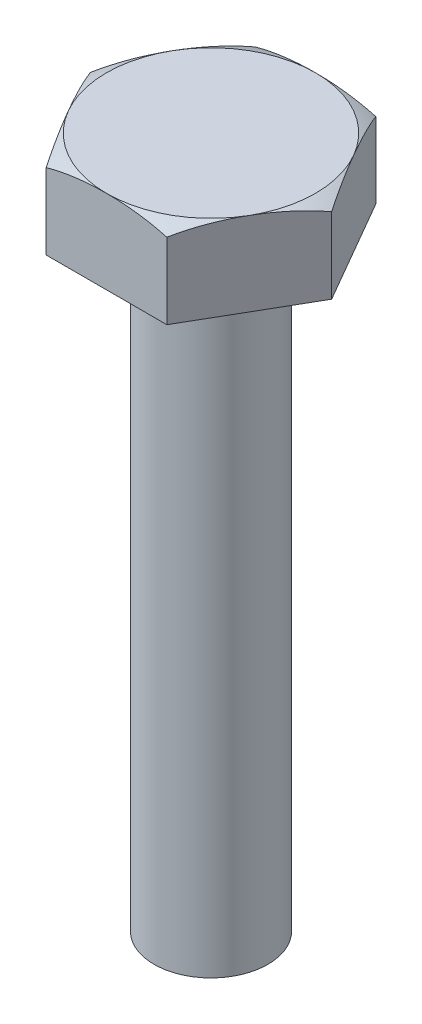
ISO-10303-21;
HEADER;
FILE_DESCRIPTION(('STEP AP214'),'2;1');
FILE_NAME('part.step','',(''),(''),'','','');
FILE_SCHEMA(('AUTOMOTIVE_DESIGN { 1 0 10303 214 1 1 1 1 }'));
ENDSEC;
DATA;
#1=APPLICATION_CONTEXT('core data for automotive mechanical design processes');
#2=APPLICATION_PROTOCOL_DEFINITION('international standard','automotive_design',2000,#1);
#3=PRODUCT_CONTEXT('',#1,'mechanical');
#4=PRODUCT('Part','Part','',(#3));
#5=PRODUCT_RELATED_PRODUCT_CATEGORY('part','',(#4));
#6=PRODUCT_DEFINITION_FORMATION('','',#4);
#7=PRODUCT_DEFINITION_CONTEXT('part definition',#1,'design');
#8=PRODUCT_DEFINITION('design','',#6,#7);
#9=PRODUCT_DEFINITION_SHAPE('','',#8);
#10=(LENGTH_UNIT() NAMED_UNIT(*) SI_UNIT(.MILLI.,.METRE.));
#11=(NAMED_UNIT(*) PLANE_ANGLE_UNIT() SI_UNIT($,.RADIAN.));
#12=(NAMED_UNIT(*) SI_UNIT($,.STERADIAN.) SOLID_ANGLE_UNIT());
#13=UNCERTAINTY_MEASURE_WITH_UNIT(LENGTH_MEASURE(1.E-05),#10,'distance_accuracy_value','');
#14=(GEOMETRIC_REPRESENTATION_CONTEXT(3) GLOBAL_UNCERTAINTY_ASSIGNED_CONTEXT((#13)) GLOBAL_UNIT_ASSIGNED_CONTEXT((#10,
#11,#12)) REPRESENTATION_CONTEXT('',''));
#15=CARTESIAN_POINT('',(0.,0.,0.));
#16=DIRECTION('',(0.,0.,1.));
#17=DIRECTION('',(1.,0.,0.));
#18=AXIS2_PLACEMENT_3D('',#15,#16,#17);
#19=CARTESIAN_POINT('',(1.5877132402715,2.2,2.74999999999998));
#20=DIRECTION('',(-0.866025403784442,0.,-0.499999999999995));
#21=DIRECTION('',(-0.499999999999995,0.,0.866025403784442));
#22=AXIS2_PLACEMENT_3D('',#19,#20,#21);
#23=PLANE('',#22);
#24=CARTESIAN_POINT('',(1.58759777021767,1.99397517685764,2.75019999999998));
#25=CARTESIAN_POINT('',(1.65735474059405,2.03289883855819,2.62937738312601));
#26=CARTESIAN_POINT('',(1.72790703505606,2.06574618628309,2.50717722452725));
#27=CARTESIAN_POINT('',(1.87001686874065,2.12022142000592,2.26103577233036));
#28=CARTESIAN_POINT('',(1.9415732726733,2.14186106954788,2.13709644511209));
#29=CARTESIAN_POINT('',(2.08400235674687,2.17464362019162,1.89040203502117));
#30=CARTESIAN_POINT('',(2.15486520845983,2.18596294060972,1.76766397548509));
#31=CARTESIAN_POINT('',(2.29683467720435,2.19937736424738,1.52176564249602));
#32=CARTESIAN_POINT('',(2.36794137654399,2.2014689650113,1.39860522648124));
#33=CARTESIAN_POINT('',(2.5006646409043,2.19686856462635,1.16872178926279));
#34=CARTESIAN_POINT('',(2.56229152836055,2.19130257207238,1.06198088907623));
#35=CARTESIAN_POINT('',(2.68525591211089,2.17306176488576,0.849000328899248));
#36=CARTESIAN_POINT('',(2.74659353413958,2.16039039550235,0.742760451130094));
#37=CARTESIAN_POINT('',(2.86970549332738,2.12719948420656,0.529524282797477));
#38=CARTESIAN_POINT('',(2.93147207029067,2.10656240051064,0.42254143328744));
#39=CARTESIAN_POINT('',(3.05420872201694,2.05680011487708,0.209955316546661));
#40=CARTESIAN_POINT('',(3.11517787454786,2.02766586102594,0.104353646668687));
#41=CARTESIAN_POINT('',(3.17554195059678,1.99397517685764,-0.000200000000000334));
#42=B_SPLINE_CURVE_WITH_KNOTS('',3,(#24,#25,#26,#27,#28,#29,#30,#31,#32,#33,#34,#35,#36,#37,#38,
#39,#40,#41),.UNSPECIFIED.,.F.,.F.,(4,2,2,2,2,2,2,2,4),(0.,0.434244212082956,0.868031715207851,
1.29425673382773,1.72064351569048,2.0905909374031,2.46035913423433,2.83580614787069,
3.21165458987835),.UNSPECIFIED.);
#43=CARTESIAN_POINT('',(1.58771324025552,1.99403962628832,2.74999999999998));
#44=VERTEX_POINT('',#43);
#45=CARTESIAN_POINT('',(2.3815698604072,2.2,1.37499999999998));
#46=VERTEX_POINT('',#45);
#47=EDGE_CURVE('E213',#44,#46,#42,.T.);
#48=ORIENTED_EDGE('',*,*,#47,.F.);
#49=DIRECTION('',(0.,-1.,0.));
#50=VECTOR('',#49,1.);
#51=CARTESIAN_POINT('',(1.5877132402715,2.2,2.74999999999998));
#52=LINE('',#51,#50);
#53=CARTESIAN_POINT('',(1.5877132402715,0.,2.74999999999998));
#54=VERTEX_POINT('',#53);
#55=EDGE_CURVE('E58',#44,#54,#52,.T.);
#56=ORIENTED_EDGE('',*,*,#55,.T.);
#57=DIRECTION('',(0.499999999999995,0.,-0.866025403784442));
#58=VECTOR('',#57,1.);
#59=CARTESIAN_POINT('',(1.5877132402715,0.,2.74999999999998));
#60=LINE('',#59,#58);
#61=CARTESIAN_POINT('',(3.17542648054294,0.,0.));
#62=VERTEX_POINT('',#61);
#63=EDGE_CURVE('E217',#54,#62,#60,.T.);
#64=ORIENTED_EDGE('',*,*,#63,.T.);
#65=DIRECTION('',(0.,-1.,0.));
#66=VECTOR('',#65,1.);
#67=CARTESIAN_POINT('',(3.17542648054294,2.2,0.));
#68=LINE('',#67,#66);
#69=CARTESIAN_POINT('',(3.17542648052862,1.99403962629186,-2.48178102897653E-11));
#70=VERTEX_POINT('',#69);
#71=EDGE_CURVE('E235',#70,#62,#68,.T.);
#72=ORIENTED_EDGE('',*,*,#71,.F.);
#73=EDGE_CURVE('E215',#46,#70,#42,.T.);
#74=ORIENTED_EDGE('',*,*,#73,.F.);
#75=EDGE_LOOP('',(#48,#56,#64,#72,#74));
#76=FACE_BOUND('',#75,.T.);
#77=ADVANCED_FACE('F34',(#76),#23,.F.);
#78=CARTESIAN_POINT('',(3.17542648054294,2.2,0.));
#79=DIRECTION('',(-0.866025403784438,0.,0.500000000000001));
#80=DIRECTION('',(0.500000000000001,0.,0.866025403784438));
#81=AXIS2_PLACEMENT_3D('',#78,#79,#80);
#82=PLANE('',#81);
#83=CARTESIAN_POINT('',(3.17554195059678,1.99397517685764,0.0002));
#84=CARTESIAN_POINT('',(3.1057849802204,2.03289883855819,-0.120622616873973));
#85=CARTESIAN_POINT('',(3.03523268575839,2.06574618628309,-0.242822775472732));
#86=CARTESIAN_POINT('',(2.89312285207379,2.12022142000592,-0.488964227669619));
#87=CARTESIAN_POINT('',(2.82156644814114,2.14186106954789,-0.61290355488789));
#88=CARTESIAN_POINT('',(2.67913736406757,2.17464362019162,-0.859597964978808));
#89=CARTESIAN_POINT('',(2.60827451235461,2.18596294060973,-0.982336024514884));
#90=CARTESIAN_POINT('',(2.46630504361009,2.19937736424738,-1.22823435750395));
#91=CARTESIAN_POINT('',(2.39519834427045,2.20146896501131,-1.35139477351874));
#92=CARTESIAN_POINT('',(2.26247507991014,2.19686856462636,-1.58127821073719));
#93=CARTESIAN_POINT('',(2.20084819245388,2.19130257207239,-1.68801911092376));
#94=CARTESIAN_POINT('',(2.07788380870354,2.17306176488576,-1.90099967110074));
#95=CARTESIAN_POINT('',(2.01654618667484,2.16039039550235,-2.00723954886989));
#96=CARTESIAN_POINT('',(1.89343422748704,2.12719948420656,-2.22047571720252));
#97=CARTESIAN_POINT('',(1.83166765052375,2.10656240051065,-2.32745856671256));
#98=CARTESIAN_POINT('',(1.70893099879748,2.05680011487708,-2.54004468345334));
#99=CARTESIAN_POINT('',(1.64796184626655,2.02766586102594,-2.64564635333132));
#100=CARTESIAN_POINT('',(1.58759777021763,1.99397517685764,-2.75020000000001));
#101=B_SPLINE_CURVE_WITH_KNOTS('',3,(#83,#84,#85,#86,#87,#88,#89,#90,#91,#92,#93,#94,#95,#96,
#97,#98,#99,#100),.UNSPECIFIED.,.F.,.F.,(4,2,2,2,2,2,2,2,4),(0.,0.434244212082956,
0.868031715207852,1.29425673382773,1.72064351569048,2.09059093740311,2.46035913423435,
2.83580614787072,3.21165458987839),.UNSPECIFIED.);
#102=CARTESIAN_POINT('',(2.38156986040719,2.2,-1.37499999999999));
#103=VERTEX_POINT('',#102);
#104=EDGE_CURVE('E262',#70,#103,#101,.T.);
#105=ORIENTED_EDGE('',*,*,#104,.F.);
#106=ORIENTED_EDGE('',*,*,#71,.T.);
#107=DIRECTION('',(-0.500000000000001,0.,-0.866025403784438));
#108=VECTOR('',#107,1.);
#109=CARTESIAN_POINT('',(3.17542648054294,0.,0.));
#110=LINE('',#109,#108);
#111=CARTESIAN_POINT('',(1.58771324027147,0.,-2.75000000000001));
#112=VERTEX_POINT('',#111);
#113=EDGE_CURVE('E252',#62,#112,#110,.T.);
#114=ORIENTED_EDGE('',*,*,#113,.T.);
#115=DIRECTION('',(0.,-1.,0.));
#116=VECTOR('',#115,1.);
#117=CARTESIAN_POINT('',(1.58771324027147,2.2,-2.75000000000001));
#118=LINE('',#117,#116);
#119=CARTESIAN_POINT('',(1.58771324027147,1.99403962628386,-2.75000000000001));
#120=VERTEX_POINT('',#119);
#121=EDGE_CURVE('E234',#120,#112,#118,.T.);
#122=ORIENTED_EDGE('',*,*,#121,.F.);
#123=EDGE_CURVE('E117',#103,#120,#101,.T.);
#124=ORIENTED_EDGE('',*,*,#123,.F.);
#125=EDGE_LOOP('',(#105,#106,#114,#122,#124));
#126=FACE_BOUND('',#125,.T.);
#127=ADVANCED_FACE('F206',(#126),#82,.F.);
#128=CARTESIAN_POINT('',(1.58771324027147,2.2,-2.75000000000001));
#129=DIRECTION('',(0.,0.,1.));
#130=DIRECTION('',(1.,0.,0.));
#131=AXIS2_PLACEMENT_3D('',#128,#129,#130);
#132=PLANE('',#131);
#133=CARTESIAN_POINT('',(3.61354192767303,-3.86327304271267,-2.75000000000001));
#134=CARTESIAN_POINT('',(3.67920515375837,-3.78751554514719,-2.75000000000001));
#135=CARTESIAN_POINT('',(3.74175196263034,-3.70905040836444,-2.75000000000001));
#136=CARTESIAN_POINT('',(3.86013726797628,-3.54719612775103,-2.75000000000001));
#137=CARTESIAN_POINT('',(3.91597474041051,-3.46380623514914,-2.75000000000001));
#138=CARTESIAN_POINT('',(4.02045498068704,-3.29260171406876,-2.75000000000001));
#139=CARTESIAN_POINT('',(4.0690964519699,-3.20478629202026,-2.75000000000001));
#140=CARTESIAN_POINT('',(4.15874530035373,-3.02537891666946,-2.75000000000001));
#141=CARTESIAN_POINT('',(4.1997532320115,-2.93378723829332,-2.75000000000001));
#142=CARTESIAN_POINT('',(4.31087034072191,-2.65398096801806,-2.75000000000002));
#143=CARTESIAN_POINT('',(4.36901199697039,-2.46083468956861,-2.75000000000002));
#144=CARTESIAN_POINT('',(4.45105454078483,-2.06761817700911,-2.75000000000002));
#145=CARTESIAN_POINT('',(4.47497671196494,-1.86755232607549,-2.75000000000002));
#146=CARTESIAN_POINT('',(4.4877078635264,-1.47118109425215,-2.75000000000002));
#147=CARTESIAN_POINT('',(4.47735876220512,-1.27490296284074,-2.75000000000002));
#148=CARTESIAN_POINT('',(4.42372525955767,-0.886873107250622,-2.75000000000002));
#149=CARTESIAN_POINT('',(4.38043502592531,-0.695122190825371,-2.75000000000002));
#150=CARTESIAN_POINT('',(4.26257552836183,-0.322195475768846,-2.75000000000002));
#151=CARTESIAN_POINT('',(4.18810848027408,-0.140987303302729,-2.75000000000001));
#152=CARTESIAN_POINT('',(4.01039043070335,0.206669546491524,-2.75000000000001));
#153=CARTESIAN_POINT('',(3.90714033102935,0.373118686023284,-2.75000000000001));
#154=CARTESIAN_POINT('',(3.67282493790998,0.690402005944507,-2.75000000000001));
#155=CARTESIAN_POINT('',(3.5412338551679,0.84084711026739,-2.75000000000001));
#156=CARTESIAN_POINT('',(3.25586014655884,1.11886355352082,-2.75000000000001));
#157=CARTESIAN_POINT('',(3.10207604013043,1.24643336509943,-2.75000000000001));
#158=CARTESIAN_POINT('',(2.76792719650014,1.48323037087921,-2.75000000000001));
#159=CARTESIAN_POINT('',(2.58655655833858,1.59103153018854,-2.75000000000001));
#160=CARTESIAN_POINT('',(2.209918429767,1.77854424736317,-2.75000000000001));
#161=CARTESIAN_POINT('',(2.01464766704068,1.8582491644533,-2.75000000000001));
#162=CARTESIAN_POINT('',(1.66765333448022,1.97363974954955,-2.75000000000001));
#163=CARTESIAN_POINT('',(1.51788141349224,2.01538549444225,-2.75));
#164=CARTESIAN_POINT('',(1.21517702161041,2.0854819305404,-2.75));
#165=CARTESIAN_POINT('',(1.06224302405238,2.11382598591734,-2.75));
#166=CARTESIAN_POINT('',(0.7540445142738,2.1583971088112,-2.75));
#167=CARTESIAN_POINT('',(0.598773186301566,2.17457591186841,-2.75));
#168=CARTESIAN_POINT('',(0.287492227271082,2.19564217048328,-2.75));
#169=CARTESIAN_POINT('',(0.131482629330214,2.20053012780464,-2.75));
#170=CARTESIAN_POINT('',(-0.186094354239489,2.1993587601162,-2.75));
#171=CARTESIAN_POINT('',(-0.347660472196816,2.19290067823936,-2.75));
#172=CARTESIAN_POINT('',(-0.669873998715494,2.16775653759,-2.75));
#173=CARTESIAN_POINT('',(-0.830521328236719,2.1490694422967,-2.75));
#174=CARTESIAN_POINT('',(-1.14910155604353,2.09836217677706,-2.75));
#175=CARTESIAN_POINT('',(-1.30704266260817,2.06639489641723,-2.75));
#176=CARTESIAN_POINT('',(-1.61916567569023,1.98780432663456,-2.74999999999999));
#177=CARTESIAN_POINT('',(-1.77334951558514,1.94118875404098,-2.74999999999999));
#178=CARTESIAN_POINT('',(-2.13874739372891,1.80954499714141,-2.74999999999999));
#179=CARTESIAN_POINT('',(-2.3472111137507,1.71660358229473,-2.74999999999999));
#180=CARTESIAN_POINT('',(-2.74618767044452,1.49772007480806,-2.74999999999999));
#181=CARTESIAN_POINT('',(-2.93670142577896,1.3717796722741,-2.74999999999999));
#182=CARTESIAN_POINT('',(-3.29363002803232,1.08740389153575,-2.74999999999999));
#183=CARTESIAN_POINT('',(-3.45990682757709,0.928793909082675,-2.74999999999999));
#184=CARTESIAN_POINT('',(-3.76011448643433,0.58335089151248,-2.74999999999999));
#185=CARTESIAN_POINT('',(-3.89405150469049,0.396523241338111,-2.74999999999999));
#186=CARTESIAN_POINT('',(-4.11316765720423,0.0188453762913879,-2.74999999999999));
#187=CARTESIAN_POINT('',(-4.20168697643794,-0.170072302267666,-2.74999999999999));
#188=CARTESIAN_POINT('',(-4.34388706228101,-0.560578145800984,-2.74999999999999));
#189=CARTESIAN_POINT('',(-4.39758072064666,-0.762161591818494,-2.74999999999998));
#190=CARTESIAN_POINT('',(-4.46639330879461,-1.16160452086589,-2.74999999999998));
#191=CARTESIAN_POINT('',(-4.48327299376118,-1.35916271104197,-2.74999999999998));
#192=CARTESIAN_POINT('',(-4.48314329927845,-1.75425671067879,-2.74999999999998));
#193=CARTESIAN_POINT('',(-4.46613904975492,-1.9517925190001,-2.74999999999998));
#194=CARTESIAN_POINT('',(-4.39928607970651,-2.3385592621985,-2.74999999999998));
#195=CARTESIAN_POINT('',(-4.34986389612912,-2.52786445931962,-2.74999999999998));
#196=CARTESIAN_POINT('',(-4.22022237715089,-2.89561653417511,-2.74999999999999));
#197=CARTESIAN_POINT('',(-4.14001083250568,-3.07406614551987,-2.74999999999999));
#198=CARTESIAN_POINT('',(-3.9848152568671,-3.35508310728068,-2.74999999999999));
#199=CARTESIAN_POINT('',(-3.91795136207254,-3.46222931800156,-2.74999999999999));
#200=CARTESIAN_POINT('',(-3.77353961774678,-3.66874577687791,-2.74999999999999));
#201=CARTESIAN_POINT('',(-3.69601347353394,-3.76813119529961,-2.74999999999999));
#202=CARTESIAN_POINT('',(-3.61354192767304,-3.86327304271268,-2.74999999999999));
#203=B_SPLINE_CURVE_WITH_KNOTS('',3,(#133,#134,#135,#136,#137,#138,#139,#140,#141,#142,#143,
#144,#145,#146,#147,#148,#149,#150,#151,#152,#153,#154,#155,#156,#157,#158,#159,#160,#161,#162,
#163,#164,#165,#166,#167,#168,#169,#170,#171,#172,#173,#174,#175,#176,#177,#178,#179,#180,#181,
#182,#183,#184,#185,#186,#187,#188,#189,#190,#191,#192,#193,#194,#195,#196,#197,#198,#199,#200,
#201,#202),.UNSPECIFIED.,.F.,.F.,(4,2,2,2,2,2,2,2,2,2,2,2,2,2,2,2,2,2,2,2,2,2,2,2,2,2,2,2,2,2,2,
2,2,2,4),(0.,0.300683542050386,0.601412919009879,0.902196414897401,1.2029580511107,
1.80482679372907,2.40632102690421,2.99314945443728,3.58008180552783,4.16510473438295,
4.75010933579825,5.3470809521294,5.94409241260724,6.57451436214468,7.20508521728016,
7.67091061348533,8.13696642158713,8.60486164402899,9.07273607286824,9.55738440803847,
10.0420738269113,10.5248511439352,11.0073745554564,11.6892131114826,12.3710167526718,
13.0565635547703,13.7419796948752,14.364674808172,14.9871392805552,15.5791121128826,
16.1709953291129,16.7552430101009,17.3393429539009,17.7175926397199,18.0950834101514),.UNSPECIFIED.);
#204=CARTESIAN_POINT('',(0.,2.2,-2.74999999999998));
#205=VERTEX_POINT('',#204);
#206=EDGE_CURVE('E110',#120,#205,#203,.T.);
#207=ORIENTED_EDGE('',*,*,#206,.F.);
#208=ORIENTED_EDGE('',*,*,#121,.T.);
#209=DIRECTION('',(-1.,0.,0.));
#210=VECTOR('',#209,1.);
#211=CARTESIAN_POINT('',(1.58771324027147,0.,-2.75000000000001));
#212=LINE('',#211,#210);
#213=CARTESIAN_POINT('',(-1.58771324027148,0.,-2.74999999999999));
#214=VERTEX_POINT('',#213);
#215=EDGE_CURVE('E254',#112,#214,#212,.T.);
#216=ORIENTED_EDGE('',*,*,#215,.T.);
#217=DIRECTION('',(0.,-1.,0.));
#218=VECTOR('',#217,1.);
#219=CARTESIAN_POINT('',(-1.58771324027148,2.2,-2.74999999999999));
#220=LINE('',#219,#218);
#221=CARTESIAN_POINT('',(-1.58771324028584,1.99403962629187,-2.74999999997514));
#222=VERTEX_POINT('',#221);
#223=EDGE_CURVE('E141',#222,#214,#220,.T.);
#224=ORIENTED_EDGE('',*,*,#223,.F.);
#225=EDGE_CURVE('E121',#205,#222,#203,.T.);
#226=ORIENTED_EDGE('',*,*,#225,.F.);
#227=EDGE_LOOP('',(#207,#208,#216,#224,#226));
#228=FACE_BOUND('',#227,.T.);
#229=ADVANCED_FACE('F139',(#228),#132,.F.);
#230=CARTESIAN_POINT('',(-1.58771324027148,2.2,-2.74999999999999));
#231=DIRECTION('',(0.866025403784442,0.,0.499999999999995));
#232=DIRECTION('',(0.499999999999995,0.,-0.866025403784442));
#233=AXIS2_PLACEMENT_3D('',#230,#231,#232);
#234=PLANE('',#233);
#235=CARTESIAN_POINT('',(-1.58759777021765,1.99397517685764,-2.75019999999999));
#236=CARTESIAN_POINT('',(-1.65735474059403,2.03289883855819,-2.62937738312602));
#237=CARTESIAN_POINT('',(-1.72790703505604,2.06574618628309,-2.50717722452726));
#238=CARTESIAN_POINT('',(-1.87001686874063,2.12022142000592,-2.26103577233037));
#239=CARTESIAN_POINT('',(-1.94157327267328,2.14186106954789,-2.1370964451121));
#240=CARTESIAN_POINT('',(-2.08400235674685,2.17464362019162,-1.89040203502118));
#241=CARTESIAN_POINT('',(-2.15486520845981,2.18596294060973,-1.76766397548511));
#242=CARTESIAN_POINT('',(-2.29683467720433,2.19937736424738,-1.52176564249604));
#243=CARTESIAN_POINT('',(-2.36794137654397,2.20146896501131,-1.39860522648125));
#244=CARTESIAN_POINT('',(-2.50066464090428,2.19686856462636,-1.1687217892628));
#245=CARTESIAN_POINT('',(-2.56229152836054,2.19130257207239,-1.06198088907623));
#246=CARTESIAN_POINT('',(-2.68525591211087,2.17306176488576,-0.849000328899249));
#247=CARTESIAN_POINT('',(-2.74659353413957,2.16039039550236,-0.742760451130092));
#248=CARTESIAN_POINT('',(-2.86970549332737,2.12719948420656,-0.529524282797469));
#249=CARTESIAN_POINT('',(-2.93147207029067,2.10656240051065,-0.422541433287429));
#250=CARTESIAN_POINT('',(-3.05420872201693,2.05680011487708,-0.209955316546644));
#251=CARTESIAN_POINT('',(-3.11517787454786,2.02766586102594,-0.104353646668667));
#252=CARTESIAN_POINT('',(-3.17554195059678,1.99397517685764,0.000200000000021938));
#253=B_SPLINE_CURVE_WITH_KNOTS('',3,(#235,#236,#237,#238,#239,#240,#241,#242,#243,#244,#245,
#246,#247,#248,#249,#250,#251,#252),.UNSPECIFIED.,.F.,.F.,(4,2,2,2,2,2,2,2,4),(0.,
0.434244212082957,0.868031715207852,1.29425673382773,1.72064351569048,2.09059093740311,
2.46035913423435,2.83580614787072,3.21165458987839),.UNSPECIFIED.);
#254=CARTESIAN_POINT('',(-2.3815698604072,2.2,-1.37499999999998));
#255=VERTEX_POINT('',#254);
#256=EDGE_CURVE('E128',#222,#255,#253,.T.);
#257=ORIENTED_EDGE('',*,*,#256,.F.);
#258=ORIENTED_EDGE('',*,*,#223,.T.);
#259=DIRECTION('',(-0.499999999999995,0.,0.866025403784442));
#260=VECTOR('',#259,1.);
#261=CARTESIAN_POINT('',(-1.58771324027148,0.,-2.74999999999999));
#262=LINE('',#261,#260);
#263=CARTESIAN_POINT('',(-3.17542648054294,0.,0.));
#264=VERTEX_POINT('',#263);
#265=EDGE_CURVE('E249',#214,#264,#262,.T.);
#266=ORIENTED_EDGE('',*,*,#265,.T.);
#267=DIRECTION('',(0.,-1.,0.));
#268=VECTOR('',#267,1.);
#269=CARTESIAN_POINT('',(-3.17542648054294,2.2,0.));
#270=LINE('',#269,#268);
#271=CARTESIAN_POINT('',(-3.17542648052861,1.99403962629186,2.48496030176258E-11));
#272=VERTEX_POINT('',#271);
#273=EDGE_CURVE('E226',#272,#264,#270,.T.);
#274=ORIENTED_EDGE('',*,*,#273,.F.);
#275=EDGE_CURVE('E142',#255,#272,#253,.T.);
#276=ORIENTED_EDGE('',*,*,#275,.F.);
#277=EDGE_LOOP('',(#257,#258,#266,#274,#276));
#278=FACE_BOUND('',#277,.T.);
#279=ADVANCED_FACE('F197',(#278),#234,.F.);
#280=CARTESIAN_POINT('',(-3.17542648054294,2.2,0.));
#281=DIRECTION('',(0.866025403784435,0.,-0.500000000000007));
#282=DIRECTION('',(-0.500000000000007,0.,-0.866025403784435));
#283=AXIS2_PLACEMENT_3D('',#280,#281,#282);
#284=PLANE('',#283);
#285=CARTESIAN_POINT('',(-3.17554195059678,1.99397517685764,-0.000199999999977892));
#286=CARTESIAN_POINT('',(-3.1057849802204,2.03289883855819,0.120622616873995));
#287=CARTESIAN_POINT('',(-3.03523268575839,2.06574618628309,0.242822775472754));
#288=CARTESIAN_POINT('',(-2.89312285207379,2.12022142000592,0.488964227669639));
#289=CARTESIAN_POINT('',(-2.82156644814114,2.14186106954789,0.612903554887909));
#290=CARTESIAN_POINT('',(-2.67913736406757,2.17464362019162,0.859597964978826));
#291=CARTESIAN_POINT('',(-2.6082745123546,2.18596294060973,0.982336024514902));
#292=CARTESIAN_POINT('',(-2.46630504361008,2.19937736424738,1.22823435750397));
#293=CARTESIAN_POINT('',(-2.39519834427044,2.20146896501131,1.35139477351875));
#294=CARTESIAN_POINT('',(-2.26247507991013,2.19686856462636,1.5812782107372));
#295=CARTESIAN_POINT('',(-2.20084819245387,2.19130257207239,1.68801911092377));
#296=CARTESIAN_POINT('',(-2.07788380870353,2.17306176488576,1.90099967110075));
#297=CARTESIAN_POINT('',(-2.01654618667483,2.16039039550236,2.00723954886991));
#298=CARTESIAN_POINT('',(-1.89343422748703,2.12719948420656,2.22047571720253));
#299=CARTESIAN_POINT('',(-1.83166765052373,2.10656240051065,2.32745856671257));
#300=CARTESIAN_POINT('',(-1.70893099879746,2.05680011487708,2.54004468345335));
#301=CARTESIAN_POINT('',(-1.64796184626654,2.02766586102594,2.64564635333133));
#302=CARTESIAN_POINT('',(-1.58759777021761,1.99397517685764,2.75020000000002));
#303=B_SPLINE_CURVE_WITH_KNOTS('',3,(#285,#286,#287,#288,#289,#290,#291,#292,#293,#294,#295,
#296,#297,#298,#299,#300,#301,#302),.UNSPECIFIED.,.F.,.F.,(4,2,2,2,2,2,2,2,4),(0.,
0.434244212082956,0.868031715207851,1.29425673382773,1.72064351569048,2.09059093740311,
2.46035913423435,2.83580614787072,3.21165458987839),.UNSPECIFIED.);
#304=CARTESIAN_POINT('',(-2.38156986040718,2.2,1.37500000000001));
#305=VERTEX_POINT('',#304);
#306=EDGE_CURVE('E191',#272,#305,#303,.T.);
#307=ORIENTED_EDGE('',*,*,#306,.F.);
#308=ORIENTED_EDGE('',*,*,#273,.T.);
#309=DIRECTION('',(0.500000000000007,0.,0.866025403784435));
#310=VECTOR('',#309,1.);
#311=CARTESIAN_POINT('',(-3.17542648054294,0.,0.));
#312=LINE('',#311,#310);
#313=CARTESIAN_POINT('',(-1.58771324027145,0.,2.75000000000002));
#314=VERTEX_POINT('',#313);
#315=EDGE_CURVE('E228',#264,#314,#312,.T.);
#316=ORIENTED_EDGE('',*,*,#315,.T.);
#317=DIRECTION('',(0.,-1.,0.));
#318=VECTOR('',#317,1.);
#319=CARTESIAN_POINT('',(-1.58771324027145,2.2,2.75000000000002));
#320=LINE('',#319,#318);
#321=CARTESIAN_POINT('',(-1.58771324027145,1.99403962628386,2.75000000000002));
#322=VERTEX_POINT('',#321);
#323=EDGE_CURVE('E224',#322,#314,#320,.T.);
#324=ORIENTED_EDGE('',*,*,#323,.F.);
#325=EDGE_CURVE('E184',#305,#322,#303,.T.);
#326=ORIENTED_EDGE('',*,*,#325,.F.);
#327=EDGE_LOOP('',(#307,#308,#316,#324,#326));
#328=FACE_BOUND('',#327,.T.);
#329=ADVANCED_FACE('F193',(#328),#284,.F.);
#330=CARTESIAN_POINT('',(-1.58771324027145,2.2,2.75000000000002));
#331=DIRECTION('',(0.,0.,-1.));
#332=DIRECTION('',(-1.,0.,0.));
#333=AXIS2_PLACEMENT_3D('',#330,#331,#332);
#334=PLANE('',#333);
#335=CARTESIAN_POINT('',(-3.61354192767303,-3.86327304271264,2.75000000000004));
#336=CARTESIAN_POINT('',(-3.67920515375837,-3.78751554514717,2.75000000000004));
#337=CARTESIAN_POINT('',(-3.74175196263034,-3.70905040836441,2.75000000000004));
#338=CARTESIAN_POINT('',(-3.86013726797628,-3.547196127751,2.75000000000004));
#339=CARTESIAN_POINT('',(-3.91597474041051,-3.46380623514911,2.75000000000004));
#340=CARTESIAN_POINT('',(-4.02045498068704,-3.29260171406873,2.75000000000004));
#341=CARTESIAN_POINT('',(-4.0690964519699,-3.20478629202023,2.75000000000004));
#342=CARTESIAN_POINT('',(-4.15874530035372,-3.02537891666943,2.75000000000004));
#343=CARTESIAN_POINT('',(-4.1997532320115,-2.93378723829329,2.75000000000004));
#344=CARTESIAN_POINT('',(-4.3108703407219,-2.65398096801803,2.75000000000004));
#345=CARTESIAN_POINT('',(-4.36901199697039,-2.46083468956858,2.75000000000005));
#346=CARTESIAN_POINT('',(-4.45105454078482,-2.06761817700907,2.75000000000005));
#347=CARTESIAN_POINT('',(-4.47497671196493,-1.86755232607545,2.75000000000005));
#348=CARTESIAN_POINT('',(-4.48770786352638,-1.47118109425212,2.75000000000005));
#349=CARTESIAN_POINT('',(-4.4773587622051,-1.2749029628407,2.75000000000005));
#350=CARTESIAN_POINT('',(-4.42372525955765,-0.886873107250589,2.75000000000005));
#351=CARTESIAN_POINT('',(-4.38043502592528,-0.695122190825339,2.75000000000005));
#352=CARTESIAN_POINT('',(-4.2625755283618,-0.322195475768814,2.75000000000004));
#353=CARTESIAN_POINT('',(-4.18810848027405,-0.140987303302698,2.75000000000004));
#354=CARTESIAN_POINT('',(-4.01039043070331,0.206669546491554,2.75000000000004));
#355=CARTESIAN_POINT('',(-3.90714033102931,0.373118686023312,2.75000000000004));
#356=CARTESIAN_POINT('',(-3.67282493790993,0.690402005944532,2.75000000000004));
#357=CARTESIAN_POINT('',(-3.54123385516786,0.840847110267416,2.75000000000004));
#358=CARTESIAN_POINT('',(-3.2558601465588,1.11886355352084,2.75000000000003));
#359=CARTESIAN_POINT('',(-3.10207604013039,1.24643336509946,2.75000000000003));
#360=CARTESIAN_POINT('',(-2.76792719650009,1.48323037087923,2.75000000000003));
#361=CARTESIAN_POINT('',(-2.58655655833853,1.59103153018855,2.75000000000003));
#362=CARTESIAN_POINT('',(-2.20991842976695,1.77854424736318,2.75000000000002));
#363=CARTESIAN_POINT('',(-2.01464766704063,1.85824916445332,2.75000000000002));
#364=CARTESIAN_POINT('',(-1.66765333448017,1.97363974954956,2.75000000000002));
#365=CARTESIAN_POINT('',(-1.51788141349218,2.01538549444226,2.75000000000002));
#366=CARTESIAN_POINT('',(-1.21517702161035,2.08548193054041,2.75000000000001));
#367=CARTESIAN_POINT('',(-1.06224302405231,2.11382598591735,2.75000000000001));
#368=CARTESIAN_POINT('',(-0.754044514273732,2.1583971088112,2.75000000000001));
#369=CARTESIAN_POINT('',(-0.598773186301496,2.17457591186842,2.75000000000001));
#370=CARTESIAN_POINT('',(-0.28749222727101,2.19564217048328,2.75));
#371=CARTESIAN_POINT('',(-0.131482629330141,2.20053012780464,2.75));
#372=CARTESIAN_POINT('',(0.186094354239566,2.1993587601162,2.75));
#373=CARTESIAN_POINT('',(0.347660472196895,2.19290067823936,2.75));
#374=CARTESIAN_POINT('',(0.669873998715575,2.16775653759,2.74999999999999));
#375=CARTESIAN_POINT('',(0.8305213282368,2.14906944229669,2.74999999999999));
#376=CARTESIAN_POINT('',(1.14910155604361,2.09836217677705,2.74999999999999));
#377=CARTESIAN_POINT('',(1.30704266260826,2.06639489641722,2.74999999999999));
#378=CARTESIAN_POINT('',(1.61916567569032,1.98780432663454,2.74999999999998));
#379=CARTESIAN_POINT('',(1.77334951558523,1.94118875404096,2.74999999999998));
#380=CARTESIAN_POINT('',(2.13874739372899,1.80954499714139,2.74999999999998));
#381=CARTESIAN_POINT('',(2.34721111375078,1.7166035822947,2.74999999999998));
#382=CARTESIAN_POINT('',(2.74618767044459,1.49772007480803,2.74999999999997));
#383=CARTESIAN_POINT('',(2.93670142577903,1.37177967227406,2.74999999999997));
#384=CARTESIAN_POINT('',(3.29363002803238,1.08740389153571,2.74999999999997));
#385=CARTESIAN_POINT('',(3.45990682757715,0.928793909082632,2.74999999999996));
#386=CARTESIAN_POINT('',(3.76011448643438,0.583350891512435,2.74999999999996));
#387=CARTESIAN_POINT('',(3.89405150469054,0.396523241338066,2.74999999999996));
#388=CARTESIAN_POINT('',(4.11316765720428,0.0188453762913422,2.74999999999996));
#389=CARTESIAN_POINT('',(4.20168697643797,-0.170072302267712,2.74999999999996));
#390=CARTESIAN_POINT('',(4.34388706228104,-0.560578145801032,2.74999999999996));
#391=CARTESIAN_POINT('',(4.39758072064669,-0.762161591818542,2.74999999999995));
#392=CARTESIAN_POINT('',(4.46639330879464,-1.16160452086594,2.74999999999995));
#393=CARTESIAN_POINT('',(4.4832729937612,-1.35916271104202,2.74999999999995));
#394=CARTESIAN_POINT('',(4.48314329927846,-1.75425671067884,2.74999999999995));
#395=CARTESIAN_POINT('',(4.46613904975494,-1.95179251900015,2.74999999999995));
#396=CARTESIAN_POINT('',(4.39928607970652,-2.33855926219855,2.74999999999995));
#397=CARTESIAN_POINT('',(4.34986389612912,-2.52786445931966,2.74999999999995));
#398=CARTESIAN_POINT('',(4.22022237715089,-2.89561653417516,2.74999999999996));
#399=CARTESIAN_POINT('',(4.14001083250568,-3.07406614551992,2.74999999999996));
#400=CARTESIAN_POINT('',(3.98481525686711,-3.35508310728069,2.74999999999996));
#401=CARTESIAN_POINT('',(3.91795136207256,-3.46222931800155,2.74999999999996));
#402=CARTESIAN_POINT('',(3.77353961774685,-3.66874577687784,2.74999999999996));
#403=CARTESIAN_POINT('',(3.69601347353403,-3.76813119529952,2.74999999999996));
#404=CARTESIAN_POINT('',(3.61354192767316,-3.86327304271257,2.74999999999996));
#405=B_SPLINE_CURVE_WITH_KNOTS('',3,(#335,#336,#337,#338,#339,#340,#341,#342,#343,#344,#345,
#346,#347,#348,#349,#350,#351,#352,#353,#354,#355,#356,#357,#358,#359,#360,#361,#362,#363,#364,
#365,#366,#367,#368,#369,#370,#371,#372,#373,#374,#375,#376,#377,#378,#379,#380,#381,#382,#383,
#384,#385,#386,#387,#388,#389,#390,#391,#392,#393,#394,#395,#396,#397,#398,#399,#400,#401,#402,
#403,#404),.UNSPECIFIED.,.F.,.F.,(4,2,2,2,2,2,2,2,2,2,2,2,2,2,2,2,2,2,2,2,2,2,2,2,2,2,2,2,2,2,2,
2,2,2,4),(0.,0.300683542050386,0.60141291900988,0.902196414897401,1.2029580511107,
1.80482679372907,2.40632102690421,2.99314945443728,3.58008180552783,4.16510473438295,
4.75010933579825,5.3470809521294,5.94409241260725,6.57451436214468,7.20508521728016,
7.67091061348534,8.13696642158714,8.60486164402901,9.07273607286826,9.55738440803849,
10.0420738269113,10.5248511439352,11.0073745554564,11.6892131114826,12.3710167526719,
13.0565635547703,13.7419796948752,14.364674808172,14.9871392805552,15.5791121128826,
16.1709953291129,16.7552430101009,17.339342953901,17.7175926397198,18.0950834101513),.UNSPECIFIED.);
#406=CARTESIAN_POINT('',(0.,2.2,2.75));
#407=VERTEX_POINT('',#406);
#408=EDGE_CURVE('E192',#322,#407,#405,.T.);
#409=ORIENTED_EDGE('',*,*,#408,.F.);
#410=ORIENTED_EDGE('',*,*,#323,.T.);
#411=DIRECTION('',(1.,0.,0.));
#412=VECTOR('',#411,1.);
#413=CARTESIAN_POINT('',(-1.58771324027145,0.,2.75000000000002));
#414=LINE('',#413,#412);
#415=EDGE_CURVE('E222',#314,#54,#414,.T.);
#416=ORIENTED_EDGE('',*,*,#415,.T.);
#417=ORIENTED_EDGE('',*,*,#55,.F.);
#418=EDGE_CURVE('E135',#407,#44,#405,.T.);
#419=ORIENTED_EDGE('',*,*,#418,.F.);
#420=EDGE_LOOP('',(#409,#410,#416,#417,#419));
#421=FACE_BOUND('',#420,.T.);
#422=ADVANCED_FACE('F196',(#421),#334,.F.);
#423=CARTESIAN_POINT('',(0.,0.,0.));
#424=DIRECTION('',(0.,1.,0.));
#425=DIRECTION('',(0.,0.,1.));
#426=AXIS2_PLACEMENT_3D('',#423,#424,#425);
#427=PLANE('',#426);
#428=CARTESIAN_POINT('',(0.,0.,0.));
#429=DIRECTION('',(0.,-1.,0.));
#430=DIRECTION('',(0.,0.,-1.));
#431=AXIS2_PLACEMENT_3D('',#428,#429,#430);
#432=CIRCLE('',#431,1.5);
#433=CARTESIAN_POINT('',(0.,0.,-1.5));
#434=VERTEX_POINT('',#433);
#435=EDGE_CURVE('E11',#434,#434,#432,.T.);
#436=ORIENTED_EDGE('',*,*,#435,.F.);
#437=EDGE_LOOP('',(#436));
#438=FACE_BOUND('',#437,.T.);
#439=ORIENTED_EDGE('',*,*,#63,.F.);
#440=ORIENTED_EDGE('',*,*,#415,.F.);
#441=ORIENTED_EDGE('',*,*,#315,.F.);
#442=ORIENTED_EDGE('',*,*,#265,.F.);
#443=ORIENTED_EDGE('',*,*,#215,.F.);
#444=ORIENTED_EDGE('',*,*,#113,.F.);
#445=EDGE_LOOP('',(#439,#440,#441,#442,#443,#444));
#446=FACE_BOUND('',#445,.T.);
#447=ADVANCED_FACE('F250',(#438,#446),#427,.F.);
#448=CARTESIAN_POINT('',(0.,-1.55563491861041,0.));
#449=DIRECTION('',(0.,-1.,0.));
#450=DIRECTION('',(0.,0.,-1.));
#451=AXIS2_PLACEMENT_3D('',#448,#449,#450);
#452=DEGENERATE_TOROIDAL_SURFACE('',#451,1.19436508138958,4.06506994304966,.T.);
#453=ORIENTED_EDGE('',*,*,#325,.T.);
#454=ORIENTED_EDGE('',*,*,#408,.T.);
#455=CARTESIAN_POINT('',(0.,2.2,0.));
#456=DIRECTION('',(0.,1.,0.));
#457=DIRECTION('',(0.,0.,1.));
#458=AXIS2_PLACEMENT_3D('',#455,#456,#457);
#459=CIRCLE('',#458,2.74999999999998);
#460=EDGE_CURVE('E38',#305,#407,#459,.T.);
#461=ORIENTED_EDGE('',*,*,#460,.F.);
#462=EDGE_LOOP('',(#453,#454,#461));
#463=FACE_BOUND('',#462,.T.);
#464=ADVANCED_FACE('F170',(#463),#452,.T.);
#465=ORIENTED_EDGE('',*,*,#275,.T.);
#466=ORIENTED_EDGE('',*,*,#306,.T.);
#467=EDGE_CURVE('E132',#255,#305,#459,.T.);
#468=ORIENTED_EDGE('',*,*,#467,.F.);
#469=EDGE_LOOP('',(#465,#466,#468));
#470=FACE_BOUND('',#469,.T.);
#471=ADVANCED_FACE('F271',(#470),#452,.T.);
#472=ORIENTED_EDGE('',*,*,#225,.T.);
#473=ORIENTED_EDGE('',*,*,#256,.T.);
#474=EDGE_CURVE('E125',#205,#255,#459,.T.);
#475=ORIENTED_EDGE('',*,*,#474,.F.);
#476=EDGE_LOOP('',(#472,#473,#475));
#477=FACE_BOUND('',#476,.T.);
#478=ADVANCED_FACE('F126',(#477),#452,.T.);
#479=ORIENTED_EDGE('',*,*,#123,.T.);
#480=ORIENTED_EDGE('',*,*,#206,.T.);
#481=CARTESIAN_POINT('',(0.,2.2,0.));
#482=DIRECTION('',(0.,-1.,0.));
#483=DIRECTION('',(0.,0.,-1.));
#484=AXIS2_PLACEMENT_3D('',#481,#482,#483);
#485=CIRCLE('',#484,2.74999999999998);
#486=EDGE_CURVE('E114',#205,#103,#485,.T.);
#487=ORIENTED_EDGE('',*,*,#486,.T.);
#488=EDGE_LOOP('',(#479,#480,#487));
#489=FACE_BOUND('',#488,.T.);
#490=ADVANCED_FACE('F112',(#489),#452,.T.);
#491=ORIENTED_EDGE('',*,*,#73,.T.);
#492=ORIENTED_EDGE('',*,*,#104,.T.);
#493=EDGE_CURVE('E131',#46,#103,#459,.T.);
#494=ORIENTED_EDGE('',*,*,#493,.F.);
#495=EDGE_LOOP('',(#491,#492,#494));
#496=FACE_BOUND('',#495,.T.);
#497=ADVANCED_FACE('F168',(#496),#452,.T.);
#498=ORIENTED_EDGE('',*,*,#47,.T.);
#499=EDGE_CURVE('E43',#407,#46,#459,.T.);
#500=ORIENTED_EDGE('',*,*,#499,.F.);
#501=ORIENTED_EDGE('',*,*,#418,.T.);
#502=EDGE_LOOP('',(#498,#500,#501));
#503=FACE_BOUND('',#502,.T.);
#504=ADVANCED_FACE('F163',(#503),#452,.T.);
#505=CARTESIAN_POINT('',(0.,2.2,0.));
#506=DIRECTION('',(0.,1.,0.));
#507=DIRECTION('',(0.,0.,1.));
#508=AXIS2_PLACEMENT_3D('',#505,#506,#507);
#509=PLANE('',#508);
#510=ORIENTED_EDGE('',*,*,#460,.T.);
#511=ORIENTED_EDGE('',*,*,#499,.T.);
#512=ORIENTED_EDGE('',*,*,#493,.T.);
#513=ORIENTED_EDGE('',*,*,#486,.F.);
#514=ORIENTED_EDGE('',*,*,#474,.T.);
#515=ORIENTED_EDGE('',*,*,#467,.T.);
#516=EDGE_LOOP('',(#510,#511,#512,#513,#514,#515));
#517=FACE_BOUND('',#516,.T.);
#518=ADVANCED_FACE('F133',(#517),#509,.T.);
#519=CARTESIAN_POINT('',(0.,-16.,0.));
#520=DIRECTION('',(0.,1.,0.));
#521=DIRECTION('',(0.,0.,1.));
#522=AXIS2_PLACEMENT_3D('',#519,#520,#521);
#523=CYLINDRICAL_SURFACE('',#522,1.5);
#524=CARTESIAN_POINT('',(0.,-16.,0.));
#525=DIRECTION('',(0.,-1.,0.));
#526=DIRECTION('',(0.,0.,-1.));
#527=AXIS2_PLACEMENT_3D('',#524,#525,#526);
#528=CIRCLE('',#527,1.5);
#529=CARTESIAN_POINT('',(0.,-16.,-1.5));
#530=VERTEX_POINT('',#529);
#531=EDGE_CURVE('E136',#530,#530,#528,.T.);
#532=ORIENTED_EDGE('',*,*,#531,.F.);
#533=EDGE_LOOP('',(#532));
#534=FACE_BOUND('',#533,.T.);
#535=ORIENTED_EDGE('',*,*,#435,.T.);
#536=EDGE_LOOP('',(#535));
#537=FACE_BOUND('',#536,.T.);
#538=ADVANCED_FACE('F171',(#534,#537),#523,.T.);
#539=CARTESIAN_POINT('',(0.,-16.,0.));
#540=DIRECTION('',(0.,-1.,0.));
#541=DIRECTION('',(0.,0.,-1.));
#542=AXIS2_PLACEMENT_3D('',#539,#540,#541);
#543=PLANE('',#542);
#544=ORIENTED_EDGE('',*,*,#531,.T.);
#545=EDGE_LOOP('',(#544));
#546=FACE_BOUND('',#545,.T.);
#547=ADVANCED_FACE('F289',(#546),#543,.T.);
#548=CLOSED_SHELL('',(#77,#127,#229,#279,#329,#422,#447,#464,#471,#478,#490,#497,#504,#518,#538,#547));
#549=MANIFOLD_SOLID_BREP('B2',#548);
#550=ADVANCED_BREP_SHAPE_REPRESENTATION('',(#18,#549),#14);
#551=SHAPE_DEFINITION_REPRESENTATION(#9,#550);
ENDSEC;
END-ISO-10303-21;
